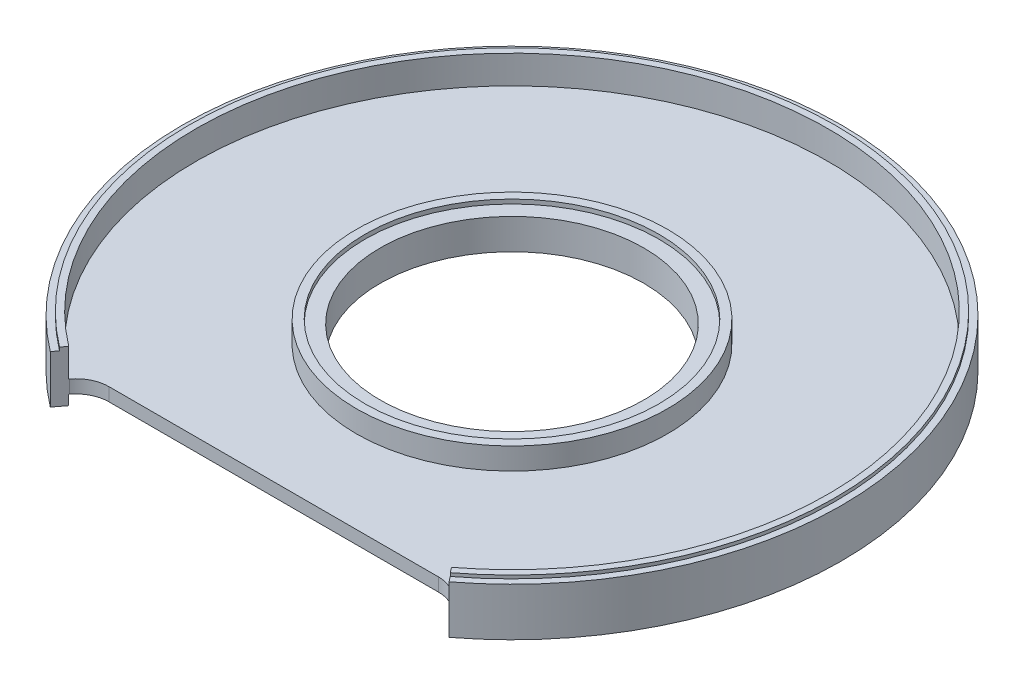
ISO-10303-21;
HEADER;
FILE_DESCRIPTION(('STEP AP214'),'2;1');
FILE_NAME('part.step','',(''),(''),'','','');
FILE_SCHEMA(('AUTOMOTIVE_DESIGN { 1 0 10303 214 1 1 1 1 }'));
ENDSEC;
DATA;
#1=APPLICATION_CONTEXT('core data for automotive mechanical design processes');
#2=APPLICATION_PROTOCOL_DEFINITION('international standard','automotive_design',2000,#1);
#3=PRODUCT_CONTEXT('',#1,'mechanical');
#4=PRODUCT('Part','Part','',(#3));
#5=PRODUCT_RELATED_PRODUCT_CATEGORY('part','',(#4));
#6=PRODUCT_DEFINITION_FORMATION('','',#4);
#7=PRODUCT_DEFINITION_CONTEXT('part definition',#1,'design');
#8=PRODUCT_DEFINITION('design','',#6,#7);
#9=PRODUCT_DEFINITION_SHAPE('','',#8);
#10=(LENGTH_UNIT() NAMED_UNIT(*) SI_UNIT(.MILLI.,.METRE.));
#11=(NAMED_UNIT(*) PLANE_ANGLE_UNIT() SI_UNIT($,.RADIAN.));
#12=(NAMED_UNIT(*) SI_UNIT($,.STERADIAN.) SOLID_ANGLE_UNIT());
#13=UNCERTAINTY_MEASURE_WITH_UNIT(LENGTH_MEASURE(1.E-05),#10,'distance_accuracy_value','');
#14=(GEOMETRIC_REPRESENTATION_CONTEXT(3) GLOBAL_UNCERTAINTY_ASSIGNED_CONTEXT((#13)) GLOBAL_UNIT_ASSIGNED_CONTEXT((#10,
#11,#12)) REPRESENTATION_CONTEXT('',''));
#15=CARTESIAN_POINT('',(0.,0.,0.));
#16=DIRECTION('',(0.,0.,1.));
#17=DIRECTION('',(1.,0.,0.));
#18=AXIS2_PLACEMENT_3D('',#15,#16,#17);
#19=CARTESIAN_POINT('',(0.,0.,0.));
#20=DIRECTION('',(0.,-1.,0.));
#21=DIRECTION('',(0.,0.,-1.));
#22=AXIS2_PLACEMENT_3D('',#19,#20,#21);
#23=CYLINDRICAL_SURFACE('',#22,23.6);
#24=CARTESIAN_POINT('',(0.,3.15,0.));
#25=DIRECTION('',(0.,-1.,0.));
#26=DIRECTION('',(0.,0.,-1.));
#27=AXIS2_PLACEMENT_3D('',#24,#25,#26);
#28=CIRCLE('',#27,23.6);
#29=CARTESIAN_POINT('',(0.,3.15,-23.6));
#30=VERTEX_POINT('',#29);
#31=EDGE_CURVE('E230',#30,#30,#28,.T.);
#32=ORIENTED_EDGE('',*,*,#31,.T.);
#33=EDGE_LOOP('',(#32));
#34=FACE_BOUND('',#33,.T.);
#35=CARTESIAN_POINT('',(0.,-0.149999999999998,0.));
#36=DIRECTION('',(0.,-1.,0.));
#37=DIRECTION('',(0.,0.,-1.));
#38=AXIS2_PLACEMENT_3D('',#35,#36,#37);
#39=CIRCLE('',#38,23.6);
#40=CARTESIAN_POINT('',(0.,-0.149999999999998,-23.6));
#41=VERTEX_POINT('',#40);
#42=EDGE_CURVE('E163',#41,#41,#39,.T.);
#43=ORIENTED_EDGE('',*,*,#42,.F.);
#44=EDGE_LOOP('',(#43));
#45=FACE_BOUND('',#44,.T.);
#46=ADVANCED_FACE('F34',(#34,#45),#23,.T.);
#47=CARTESIAN_POINT('',(0.,-0.149999999999998,0.));
#48=DIRECTION('',(0.,1.,0.));
#49=DIRECTION('',(0.,0.,1.));
#50=AXIS2_PLACEMENT_3D('',#47,#48,#49);
#51=PLANE('',#50);
#52=DIRECTION('',(-0.605050133097882,0.,0.796187375206513));
#53=VECTOR('',#52,1.);
#54=CARTESIAN_POINT('',(0.000282849567721906,-0.149999999999998,0.000214947101556877));
#55=LINE('',#54,#53);
#56=CARTESIAN_POINT('',(-28.9809368760326,-0.149999999999956,38.1366932343909));
#57=VERTEX_POINT('',#56);
#58=CARTESIAN_POINT('',(-29.0421235383352,-0.149999999999998,38.2172089559674));
#59=VERTEX_POINT('',#58);
#60=EDGE_CURVE('E56',#57,#59,#55,.T.);
#61=ORIENTED_EDGE('',*,*,#60,.F.);
#62=CARTESIAN_POINT('',(-25.,-0.150000000000011,41.1619438998803));
#63=DIRECTION('',(0.,1.,0.));
#64=DIRECTION('',(0.,0.,1.));
#65=AXIS2_PLACEMENT_3D('',#62,#63,#64);
#66=CIRCLE('',#65,5.);
#67=CARTESIAN_POINT('',(-25.,-0.149999999999956,36.1619438998803));
#68=VERTEX_POINT('',#67);
#69=EDGE_CURVE('E213',#68,#57,#66,.T.);
#70=ORIENTED_EDGE('',*,*,#69,.F.);
#71=DIRECTION('',(-1.,0.,0.));
#72=VECTOR('',#71,1.);
#73=CARTESIAN_POINT('',(0.,-0.149999999999998,36.1619438998803));
#74=LINE('',#73,#72);
#75=CARTESIAN_POINT('',(25.,-0.149999999999956,36.1619438998803));
#76=VERTEX_POINT('',#75);
#77=EDGE_CURVE('E192',#76,#68,#74,.T.);
#78=ORIENTED_EDGE('',*,*,#77,.F.);
#79=CARTESIAN_POINT('',(25.,-0.150000000000011,41.1619438998803));
#80=DIRECTION('',(0.,1.,0.));
#81=DIRECTION('',(0.,0.,1.));
#82=AXIS2_PLACEMENT_3D('',#79,#80,#81);
#83=CIRCLE('',#82,5.);
#84=CARTESIAN_POINT('',(28.9809593135091,-0.149999999999956,38.1367227601642));
#85=VERTEX_POINT('',#84);
#86=EDGE_CURVE('E210',#85,#76,#83,.T.);
#87=ORIENTED_EDGE('',*,*,#86,.F.);
#88=DIRECTION('',(-0.605044227943225,0.,-0.796191862701816));
#89=VECTOR('',#88,1.);
#90=CARTESIAN_POINT('',(0.,-0.149999999999998,0.));
#91=LINE('',#90,#89);
#92=CARTESIAN_POINT('',(29.0421229412748,-0.149999999999998,38.2172094096872));
#93=VERTEX_POINT('',#92);
#94=EDGE_CURVE('E208',#93,#85,#91,.T.);
#95=ORIENTED_EDGE('',*,*,#94,.F.);
#96=CARTESIAN_POINT('',(0.,-0.149999999999998,0.));
#97=DIRECTION('',(0.,-1.,0.));
#98=DIRECTION('',(0.,0.,-1.));
#99=AXIS2_PLACEMENT_3D('',#96,#97,#98);
#100=CIRCLE('',#99,48.);
#101=EDGE_CURVE('E160',#59,#93,#100,.T.);
#102=ORIENTED_EDGE('',*,*,#101,.F.);
#103=EDGE_LOOP('',(#61,#70,#78,#87,#95,#102));
#104=FACE_BOUND('',#103,.T.);
#105=ORIENTED_EDGE('',*,*,#42,.T.);
#106=EDGE_LOOP('',(#105));
#107=FACE_BOUND('',#106,.T.);
#108=ADVANCED_FACE('F269',(#104,#107),#51,.T.);
#109=CARTESIAN_POINT('',(0.,0.,0.));
#110=DIRECTION('',(0.,-1.,0.));
#111=DIRECTION('',(0.,0.,-1.));
#112=AXIS2_PLACEMENT_3D('',#109,#110,#111);
#113=CYLINDRICAL_SURFACE('',#112,48.);
#114=DIRECTION('',(0.,-1.,0.));
#115=VECTOR('',#114,1.);
#116=CARTESIAN_POINT('',(-29.0421235383352,0.,38.2172089559674));
#117=LINE('',#116,#115);
#118=CARTESIAN_POINT('',(-29.0421235383352,4.15,38.2172089559674));
#119=VERTEX_POINT('',#118);
#120=EDGE_CURVE('E227',#59,#119,#117,.F.);
#121=ORIENTED_EDGE('',*,*,#120,.F.);
#122=ORIENTED_EDGE('',*,*,#101,.T.);
#123=DIRECTION('',(0.,-1.,0.));
#124=VECTOR('',#123,1.);
#125=CARTESIAN_POINT('',(29.0421229412748,0.,38.2172094096872));
#126=LINE('',#125,#124);
#127=CARTESIAN_POINT('',(29.0421229412748,4.15,38.2172094096872));
#128=VERTEX_POINT('',#127);
#129=EDGE_CURVE('E206',#128,#93,#126,.T.);
#130=ORIENTED_EDGE('',*,*,#129,.F.);
#131=CARTESIAN_POINT('',(0.,4.15,0.));
#132=DIRECTION('',(0.,-1.,0.));
#133=DIRECTION('',(0.,0.,-1.));
#134=AXIS2_PLACEMENT_3D('',#131,#132,#133);
#135=CIRCLE('',#134,48.);
#136=EDGE_CURVE('E157',#119,#128,#135,.T.);
#137=ORIENTED_EDGE('',*,*,#136,.F.);
#138=EDGE_LOOP('',(#121,#122,#130,#137));
#139=FACE_BOUND('',#138,.T.);
#140=ADVANCED_FACE('F264',(#139),#113,.F.);
#141=CARTESIAN_POINT('',(0.,4.15,0.));
#142=DIRECTION('',(0.,-1.,0.));
#143=DIRECTION('',(0.,0.,-1.));
#144=AXIS2_PLACEMENT_3D('',#141,#142,#143);
#145=PLANE('',#144);
#146=CARTESIAN_POINT('',(0.,4.15,0.));
#147=DIRECTION('',(0.,-1.,0.));
#148=DIRECTION('',(0.,0.,-1.));
#149=AXIS2_PLACEMENT_3D('',#146,#147,#148);
#150=CIRCLE('',#149,49.);
#151=CARTESIAN_POINT('',(-29.6471736714493,4.15,39.0133963311953));
#152=VERTEX_POINT('',#151);
#153=CARTESIAN_POINT('',(29.647167169218,4.15,39.013401272389));
#154=VERTEX_POINT('',#153);
#155=EDGE_CURVE('E149',#152,#154,#150,.T.);
#156=ORIENTED_EDGE('',*,*,#155,.F.);
#157=DIRECTION('',(0.605050133097882,0.,-0.796187375206513));
#158=VECTOR('',#157,1.);
#159=CARTESIAN_POINT('',(0.000282849567721906,4.15,0.000214947101556877));
#160=LINE('',#159,#158);
#161=EDGE_CURVE('E224',#152,#119,#160,.T.);
#162=ORIENTED_EDGE('',*,*,#161,.T.);
#163=ORIENTED_EDGE('',*,*,#136,.T.);
#164=DIRECTION('',(0.605044227943225,0.,0.796191862701816));
#165=VECTOR('',#164,1.);
#166=CARTESIAN_POINT('',(0.,4.15,0.));
#167=LINE('',#166,#165);
#168=EDGE_CURVE('E203',#128,#154,#167,.T.);
#169=ORIENTED_EDGE('',*,*,#168,.T.);
#170=EDGE_LOOP('',(#156,#162,#163,#169));
#171=FACE_BOUND('',#170,.T.);
#172=ADVANCED_FACE('F261',(#171),#145,.F.);
#173=CARTESIAN_POINT('',(0.,0.,0.));
#174=DIRECTION('',(0.,-1.,0.));
#175=DIRECTION('',(0.,0.,-1.));
#176=AXIS2_PLACEMENT_3D('',#173,#174,#175);
#177=CYLINDRICAL_SURFACE('',#176,49.);
#178=DIRECTION('',(0.,-1.,0.));
#179=VECTOR('',#178,1.);
#180=CARTESIAN_POINT('',(-29.6471736714493,0.,39.0133963311953));
#181=LINE('',#180,#179);
#182=CARTESIAN_POINT('',(-29.6471736714493,3.65,39.0133963311953));
#183=VERTEX_POINT('',#182);
#184=EDGE_CURVE('E222',#152,#183,#181,.T.);
#185=ORIENTED_EDGE('',*,*,#184,.F.);
#186=ORIENTED_EDGE('',*,*,#155,.T.);
#187=DIRECTION('',(0.,-1.,0.));
#188=VECTOR('',#187,1.);
#189=CARTESIAN_POINT('',(29.647167169218,0.,39.013401272389));
#190=LINE('',#189,#188);
#191=CARTESIAN_POINT('',(29.647167169218,3.65,39.013401272389));
#192=VERTEX_POINT('',#191);
#193=EDGE_CURVE('E142',#192,#154,#190,.F.);
#194=ORIENTED_EDGE('',*,*,#193,.F.);
#195=CARTESIAN_POINT('',(0.,3.65,0.));
#196=DIRECTION('',(0.,-1.,0.));
#197=DIRECTION('',(0.,0.,-1.));
#198=AXIS2_PLACEMENT_3D('',#195,#196,#197);
#199=CIRCLE('',#198,49.);
#200=EDGE_CURVE('E141',#183,#192,#199,.T.);
#201=ORIENTED_EDGE('',*,*,#200,.F.);
#202=EDGE_LOOP('',(#185,#186,#194,#201));
#203=FACE_BOUND('',#202,.T.);
#204=ADVANCED_FACE('F257',(#203),#177,.T.);
#205=CARTESIAN_POINT('',(0.,3.65,0.));
#206=DIRECTION('',(0.,1.,0.));
#207=DIRECTION('',(0.,0.,1.));
#208=AXIS2_PLACEMENT_3D('',#205,#206,#207);
#209=PLANE('',#208);
#210=DIRECTION('',(-0.605050133097882,0.,0.796187375206513));
#211=VECTOR('',#210,1.);
#212=CARTESIAN_POINT('',(0.000282849567721906,3.65,0.000214947101556877));
#213=LINE('',#212,#211);
#214=CARTESIAN_POINT('',(-30.2522238045627,3.65000000000007,39.8095837064223));
#215=VERTEX_POINT('',#214);
#216=EDGE_CURVE('E220',#183,#215,#213,.T.);
#217=ORIENTED_EDGE('',*,*,#216,.F.);
#218=ORIENTED_EDGE('',*,*,#200,.T.);
#219=DIRECTION('',(-0.605044227943225,0.,-0.796191862701816));
#220=VECTOR('',#219,1.);
#221=CARTESIAN_POINT('',(0.,3.65,0.));
#222=LINE('',#221,#220);
#223=CARTESIAN_POINT('',(30.2522113971612,3.65000000000007,39.8095931350908));
#224=VERTEX_POINT('',#223);
#225=EDGE_CURVE('E124',#224,#192,#222,.T.);
#226=ORIENTED_EDGE('',*,*,#225,.F.);
#227=CARTESIAN_POINT('',(0.,3.65,0.));
#228=DIRECTION('',(0.,-1.,0.));
#229=DIRECTION('',(0.,0.,-1.));
#230=AXIS2_PLACEMENT_3D('',#227,#228,#229);
#231=CIRCLE('',#230,50.);
#232=EDGE_CURVE('E139',#215,#224,#231,.T.);
#233=ORIENTED_EDGE('',*,*,#232,.F.);
#234=EDGE_LOOP('',(#217,#218,#226,#233));
#235=FACE_BOUND('',#234,.T.);
#236=ADVANCED_FACE('F138',(#235),#209,.T.);
#237=CARTESIAN_POINT('',(0.,0.,0.));
#238=DIRECTION('',(0.,-1.,0.));
#239=DIRECTION('',(0.,0.,-1.));
#240=AXIS2_PLACEMENT_3D('',#237,#238,#239);
#241=CYLINDRICAL_SURFACE('',#240,50.);
#242=CARTESIAN_POINT('',(0.,-3.65,0.));
#243=DIRECTION('',(0.,-1.,0.));
#244=DIRECTION('',(0.,0.,-1.));
#245=AXIS2_PLACEMENT_3D('',#242,#243,#244);
#246=CIRCLE('',#245,50.);
#247=CARTESIAN_POINT('',(-30.2522238045627,-3.64999999999993,39.8095837064223));
#248=VERTEX_POINT('',#247);
#249=CARTESIAN_POINT('',(30.2522113971612,-3.64999999999993,39.8095931350908));
#250=VERTEX_POINT('',#249);
#251=EDGE_CURVE('E147',#248,#250,#246,.T.);
#252=ORIENTED_EDGE('',*,*,#251,.F.);
#253=DIRECTION('',(0.,-1.,0.));
#254=VECTOR('',#253,1.);
#255=CARTESIAN_POINT('',(-30.2522238045627,180.982868479382,39.8095837064223));
#256=LINE('',#255,#254);
#257=EDGE_CURVE('E146',#215,#248,#256,.T.);
#258=ORIENTED_EDGE('',*,*,#257,.F.);
#259=ORIENTED_EDGE('',*,*,#232,.T.);
#260=DIRECTION('',(0.,-1.,0.));
#261=VECTOR('',#260,1.);
#262=CARTESIAN_POINT('',(30.2522113971612,180.982868479382,39.8095931350908));
#263=LINE('',#262,#261);
#264=EDGE_CURVE('E121',#224,#250,#263,.T.);
#265=ORIENTED_EDGE('',*,*,#264,.T.);
#266=EDGE_LOOP('',(#252,#258,#259,#265));
#267=FACE_BOUND('',#266,.T.);
#268=ADVANCED_FACE('F145',(#267),#241,.T.);
#269=CARTESIAN_POINT('',(0.,-3.65,0.));
#270=DIRECTION('',(0.,1.,0.));
#271=DIRECTION('',(0.,0.,1.));
#272=AXIS2_PLACEMENT_3D('',#269,#270,#271);
#273=PLANE('',#272);
#274=CARTESIAN_POINT('',(0.,-3.65,0.));
#275=DIRECTION('',(0.,-1.,0.));
#276=DIRECTION('',(0.,0.,-1.));
#277=AXIS2_PLACEMENT_3D('',#274,#275,#276);
#278=CIRCLE('',#277,48.);
#279=CARTESIAN_POINT('',(-29.0421235383352,-3.65,38.2172089559674));
#280=VERTEX_POINT('',#279);
#281=CARTESIAN_POINT('',(29.0421229412748,-3.65,38.2172094096872));
#282=VERTEX_POINT('',#281);
#283=EDGE_CURVE('E151',#280,#282,#278,.T.);
#284=ORIENTED_EDGE('',*,*,#283,.F.);
#285=DIRECTION('',(-0.605050133097882,0.,0.796187375206513));
#286=VECTOR('',#285,1.);
#287=CARTESIAN_POINT('',(0.000282849567721906,-3.65,0.000214947101556877));
#288=LINE('',#287,#286);
#289=EDGE_CURVE('E217',#280,#248,#288,.T.);
#290=ORIENTED_EDGE('',*,*,#289,.T.);
#291=ORIENTED_EDGE('',*,*,#251,.T.);
#292=DIRECTION('',(-0.605044227943225,0.,-0.796191862701816));
#293=VECTOR('',#292,1.);
#294=CARTESIAN_POINT('',(0.,-3.65,0.));
#295=LINE('',#294,#293);
#296=EDGE_CURVE('E127',#250,#282,#295,.T.);
#297=ORIENTED_EDGE('',*,*,#296,.T.);
#298=EDGE_LOOP('',(#284,#290,#291,#297));
#299=FACE_BOUND('',#298,.T.);
#300=ADVANCED_FACE('F253',(#299),#273,.F.);
#301=DIRECTION('',(0.,-1.,0.));
#302=VECTOR('',#301,1.);
#303=CARTESIAN_POINT('',(-29.0421235383352,0.,38.2172089559674));
#304=LINE('',#303,#302);
#305=CARTESIAN_POINT('',(-29.0421235383352,-2.15,38.2172089559674));
#306=VERTEX_POINT('',#305);
#307=EDGE_CURVE('E215',#280,#306,#304,.F.);
#308=ORIENTED_EDGE('',*,*,#307,.F.);
#309=ORIENTED_EDGE('',*,*,#283,.T.);
#310=DIRECTION('',(0.,-1.,0.));
#311=VECTOR('',#310,1.);
#312=CARTESIAN_POINT('',(29.0421229412748,0.,38.2172094096872));
#313=LINE('',#312,#311);
#314=CARTESIAN_POINT('',(29.0421229412748,-2.15,38.2172094096872));
#315=VERTEX_POINT('',#314);
#316=EDGE_CURVE('E198',#315,#282,#313,.T.);
#317=ORIENTED_EDGE('',*,*,#316,.F.);
#318=CARTESIAN_POINT('',(0.,-2.15,0.));
#319=DIRECTION('',(0.,-1.,0.));
#320=DIRECTION('',(0.,0.,-1.));
#321=AXIS2_PLACEMENT_3D('',#318,#319,#320);
#322=CIRCLE('',#321,48.);
#323=EDGE_CURVE('E245',#306,#315,#322,.T.);
#324=ORIENTED_EDGE('',*,*,#323,.F.);
#325=EDGE_LOOP('',(#308,#309,#317,#324));
#326=FACE_BOUND('',#325,.T.);
#327=ADVANCED_FACE('F251',(#326),#113,.F.);
#328=CARTESIAN_POINT('',(0.,-2.15,0.));
#329=DIRECTION('',(0.,1.,0.));
#330=DIRECTION('',(0.,0.,1.));
#331=AXIS2_PLACEMENT_3D('',#328,#329,#330);
#332=PLANE('',#331);
#333=CARTESIAN_POINT('',(0.,-2.15,0.));
#334=DIRECTION('',(0.,-1.,0.));
#335=DIRECTION('',(0.,0.,-1.));
#336=AXIS2_PLACEMENT_3D('',#333,#334,#335);
#337=CIRCLE('',#336,20.);
#338=CARTESIAN_POINT('',(0.,-2.15,-20.));
#339=VERTEX_POINT('',#338);
#340=EDGE_CURVE('E242',#339,#339,#337,.T.);
#341=ORIENTED_EDGE('',*,*,#340,.F.);
#342=EDGE_LOOP('',(#341));
#343=FACE_BOUND('',#342,.T.);
#344=CARTESIAN_POINT('',(-25.,-2.14999999999999,41.1619438998803));
#345=DIRECTION('',(0.,1.,0.));
#346=DIRECTION('',(0.,0.,1.));
#347=AXIS2_PLACEMENT_3D('',#344,#345,#346);
#348=CIRCLE('',#347,5.);
#349=CARTESIAN_POINT('',(-25.,-2.14999999999993,36.1619438998803));
#350=VERTEX_POINT('',#349);
#351=CARTESIAN_POINT('',(-28.9809368760326,-2.14999999999993,38.1366932343909));
#352=VERTEX_POINT('',#351);
#353=EDGE_CURVE('E41',#350,#352,#348,.T.);
#354=ORIENTED_EDGE('',*,*,#353,.T.);
#355=DIRECTION('',(-0.605050133097882,0.,0.796187375206513));
#356=VECTOR('',#355,1.);
#357=CARTESIAN_POINT('',(0.000282849567721906,-2.15,0.000214947101556843));
#358=LINE('',#357,#356);
#359=EDGE_CURVE('E11',#352,#306,#358,.T.);
#360=ORIENTED_EDGE('',*,*,#359,.T.);
#361=ORIENTED_EDGE('',*,*,#323,.T.);
#362=DIRECTION('',(-0.605044227943225,0.,-0.796191862701816));
#363=VECTOR('',#362,1.);
#364=CARTESIAN_POINT('',(0.,-2.15,0.));
#365=LINE('',#364,#363);
#366=CARTESIAN_POINT('',(28.9809593135091,-2.15,38.1367227601642));
#367=VERTEX_POINT('',#366);
#368=EDGE_CURVE('E166',#315,#367,#365,.T.);
#369=ORIENTED_EDGE('',*,*,#368,.T.);
#370=CARTESIAN_POINT('',(25.,-2.14999999999999,41.1619438998803));
#371=DIRECTION('',(0.,1.,0.));
#372=DIRECTION('',(0.,0.,1.));
#373=AXIS2_PLACEMENT_3D('',#370,#371,#372);
#374=CIRCLE('',#373,5.);
#375=CARTESIAN_POINT('',(25.,-2.14999999999993,36.1619438998803));
#376=VERTEX_POINT('',#375);
#377=EDGE_CURVE('E169',#367,#376,#374,.T.);
#378=ORIENTED_EDGE('',*,*,#377,.T.);
#379=DIRECTION('',(-1.,0.,0.));
#380=VECTOR('',#379,1.);
#381=CARTESIAN_POINT('',(0.,-2.15,36.1619438998803));
#382=LINE('',#381,#380);
#383=EDGE_CURVE('E172',#376,#350,#382,.T.);
#384=ORIENTED_EDGE('',*,*,#383,.T.);
#385=EDGE_LOOP('',(#354,#360,#361,#369,#378,#384));
#386=FACE_BOUND('',#385,.T.);
#387=ADVANCED_FACE('F176',(#343,#386),#332,.F.);
#388=CARTESIAN_POINT('',(0.,0.,0.));
#389=DIRECTION('',(0.,-1.,0.));
#390=DIRECTION('',(0.,0.,-1.));
#391=AXIS2_PLACEMENT_3D('',#388,#389,#390);
#392=CYLINDRICAL_SURFACE('',#391,20.);
#393=ORIENTED_EDGE('',*,*,#340,.T.);
#394=EDGE_LOOP('',(#393));
#395=FACE_BOUND('',#394,.T.);
#396=CARTESIAN_POINT('',(0.,2.5,0.));
#397=DIRECTION('',(0.,-1.,0.));
#398=DIRECTION('',(0.,0.,-1.));
#399=AXIS2_PLACEMENT_3D('',#396,#397,#398);
#400=CIRCLE('',#399,20.);
#401=CARTESIAN_POINT('',(0.,2.5,-20.));
#402=VERTEX_POINT('',#401);
#403=EDGE_CURVE('E239',#402,#402,#400,.T.);
#404=ORIENTED_EDGE('',*,*,#403,.F.);
#405=EDGE_LOOP('',(#404));
#406=FACE_BOUND('',#405,.T.);
#407=ADVANCED_FACE('F307',(#395,#406),#392,.F.);
#408=CARTESIAN_POINT('',(0.,2.5,0.));
#409=DIRECTION('',(0.,1.,0.));
#410=DIRECTION('',(0.,0.,1.));
#411=AXIS2_PLACEMENT_3D('',#408,#409,#410);
#412=PLANE('',#411);
#413=ORIENTED_EDGE('',*,*,#403,.T.);
#414=EDGE_LOOP('',(#413));
#415=FACE_BOUND('',#414,.T.);
#416=CARTESIAN_POINT('',(0.,2.5,0.));
#417=DIRECTION('',(0.,-1.,0.));
#418=DIRECTION('',(0.,0.,-1.));
#419=AXIS2_PLACEMENT_3D('',#416,#417,#418);
#420=CIRCLE('',#419,22.3);
#421=CARTESIAN_POINT('',(0.,2.5,-22.3));
#422=VERTEX_POINT('',#421);
#423=EDGE_CURVE('E236',#422,#422,#420,.T.);
#424=ORIENTED_EDGE('',*,*,#423,.F.);
#425=EDGE_LOOP('',(#424));
#426=FACE_BOUND('',#425,.T.);
#427=ADVANCED_FACE('F300',(#415,#426),#412,.T.);
#428=CARTESIAN_POINT('',(0.,0.,0.));
#429=DIRECTION('',(0.,-1.,0.));
#430=DIRECTION('',(0.,0.,-1.));
#431=AXIS2_PLACEMENT_3D('',#428,#429,#430);
#432=CYLINDRICAL_SURFACE('',#431,22.3);
#433=CARTESIAN_POINT('',(0.,3.15,0.));
#434=DIRECTION('',(0.,-1.,0.));
#435=DIRECTION('',(0.,0.,-1.));
#436=AXIS2_PLACEMENT_3D('',#433,#434,#435);
#437=CIRCLE('',#436,22.3);
#438=CARTESIAN_POINT('',(0.,3.15,-22.3));
#439=VERTEX_POINT('',#438);
#440=EDGE_CURVE('E233',#439,#439,#437,.T.);
#441=ORIENTED_EDGE('',*,*,#440,.F.);
#442=EDGE_LOOP('',(#441));
#443=FACE_BOUND('',#442,.T.);
#444=ORIENTED_EDGE('',*,*,#423,.T.);
#445=EDGE_LOOP('',(#444));
#446=FACE_BOUND('',#445,.T.);
#447=ADVANCED_FACE('F292',(#443,#446),#432,.F.);
#448=CARTESIAN_POINT('',(0.,3.15,0.));
#449=DIRECTION('',(0.,1.,0.));
#450=DIRECTION('',(0.,0.,1.));
#451=AXIS2_PLACEMENT_3D('',#448,#449,#450);
#452=PLANE('',#451);
#453=ORIENTED_EDGE('',*,*,#440,.T.);
#454=EDGE_LOOP('',(#453));
#455=FACE_BOUND('',#454,.T.);
#456=ORIENTED_EDGE('',*,*,#31,.F.);
#457=EDGE_LOOP('',(#456));
#458=FACE_BOUND('',#457,.T.);
#459=ADVANCED_FACE('F290',(#455,#458),#452,.T.);
#460=CARTESIAN_POINT('',(-28.9809368760326,180.982868479382,38.1366932343909));
#461=DIRECTION('',(-0.796187375206512,0.,-0.605050133097882));
#462=DIRECTION('',(-0.605050133097882,0.,0.796187375206513));
#463=AXIS2_PLACEMENT_3D('',#460,#461,#462);
#464=PLANE('',#463);
#465=DIRECTION('',(0.,-1.,0.));
#466=VECTOR('',#465,1.);
#467=CARTESIAN_POINT('',(-28.9809368760326,180.982868479382,38.1366932343909));
#468=LINE('',#467,#466);
#469=EDGE_CURVE('E186',#57,#352,#468,.T.);
#470=ORIENTED_EDGE('',*,*,#469,.F.);
#471=ORIENTED_EDGE('',*,*,#60,.T.);
#472=ORIENTED_EDGE('',*,*,#120,.T.);
#473=ORIENTED_EDGE('',*,*,#161,.F.);
#474=ORIENTED_EDGE('',*,*,#184,.T.);
#475=ORIENTED_EDGE('',*,*,#216,.T.);
#476=ORIENTED_EDGE('',*,*,#257,.T.);
#477=ORIENTED_EDGE('',*,*,#289,.F.);
#478=ORIENTED_EDGE('',*,*,#307,.T.);
#479=ORIENTED_EDGE('',*,*,#359,.F.);
#480=EDGE_LOOP('',(#470,#471,#472,#473,#474,#475,#476,#477,#478,#479));
#481=FACE_BOUND('',#480,.T.);
#482=ADVANCED_FACE('F254',(#481),#464,.F.);
#483=CARTESIAN_POINT('',(-25.,180.982868479382,41.1619438998803));
#484=DIRECTION('',(0.,-1.,0.));
#485=DIRECTION('',(0.,0.,-1.));
#486=AXIS2_PLACEMENT_3D('',#483,#484,#485);
#487=CYLINDRICAL_SURFACE('',#486,5.);
#488=DIRECTION('',(0.,-1.,0.));
#489=VECTOR('',#488,1.);
#490=CARTESIAN_POINT('',(-25.,180.982868479382,36.1619438998803));
#491=LINE('',#490,#489);
#492=EDGE_CURVE('E184',#68,#350,#491,.T.);
#493=ORIENTED_EDGE('',*,*,#492,.F.);
#494=ORIENTED_EDGE('',*,*,#69,.T.);
#495=ORIENTED_EDGE('',*,*,#469,.T.);
#496=ORIENTED_EDGE('',*,*,#353,.F.);
#497=EDGE_LOOP('',(#493,#494,#495,#496));
#498=FACE_BOUND('',#497,.T.);
#499=ADVANCED_FACE('F183',(#498),#487,.F.);
#500=CARTESIAN_POINT('',(-25.,180.982868479382,36.1619438998803));
#501=DIRECTION('',(0.,0.,-1.));
#502=DIRECTION('',(-1.,0.,0.));
#503=AXIS2_PLACEMENT_3D('',#500,#501,#502);
#504=PLANE('',#503);
#505=DIRECTION('',(0.,-1.,0.));
#506=VECTOR('',#505,1.);
#507=CARTESIAN_POINT('',(25.,180.982868479382,36.1619438998803));
#508=LINE('',#507,#506);
#509=EDGE_CURVE('E132',#76,#376,#508,.T.);
#510=ORIENTED_EDGE('',*,*,#509,.F.);
#511=ORIENTED_EDGE('',*,*,#77,.T.);
#512=ORIENTED_EDGE('',*,*,#492,.T.);
#513=ORIENTED_EDGE('',*,*,#383,.F.);
#514=EDGE_LOOP('',(#510,#511,#512,#513));
#515=FACE_BOUND('',#514,.T.);
#516=ADVANCED_FACE('F189',(#515),#504,.F.);
#517=CARTESIAN_POINT('',(25.,180.982868479382,41.1619438998803));
#518=DIRECTION('',(0.,-1.,0.));
#519=DIRECTION('',(0.,0.,-1.));
#520=AXIS2_PLACEMENT_3D('',#517,#518,#519);
#521=CYLINDRICAL_SURFACE('',#520,5.);
#522=DIRECTION('',(0.,-1.,0.));
#523=VECTOR('',#522,1.);
#524=CARTESIAN_POINT('',(28.9809593135091,180.982868479382,38.1367227601642));
#525=LINE('',#524,#523);
#526=EDGE_CURVE('E48',#85,#367,#525,.T.);
#527=ORIENTED_EDGE('',*,*,#526,.F.);
#528=ORIENTED_EDGE('',*,*,#86,.T.);
#529=ORIENTED_EDGE('',*,*,#509,.T.);
#530=ORIENTED_EDGE('',*,*,#377,.F.);
#531=EDGE_LOOP('',(#527,#528,#529,#530));
#532=FACE_BOUND('',#531,.T.);
#533=ADVANCED_FACE('F272',(#532),#521,.F.);
#534=CARTESIAN_POINT('',(28.9809593135091,180.982868479382,38.1367227601642));
#535=DIRECTION('',(0.796191862701816,0.,-0.605044227943225));
#536=DIRECTION('',(-0.605044227943225,0.,-0.796191862701816));
#537=AXIS2_PLACEMENT_3D('',#534,#535,#536);
#538=PLANE('',#537);
#539=ORIENTED_EDGE('',*,*,#129,.T.);
#540=ORIENTED_EDGE('',*,*,#94,.T.);
#541=ORIENTED_EDGE('',*,*,#526,.T.);
#542=ORIENTED_EDGE('',*,*,#368,.F.);
#543=ORIENTED_EDGE('',*,*,#316,.T.);
#544=ORIENTED_EDGE('',*,*,#296,.F.);
#545=ORIENTED_EDGE('',*,*,#264,.F.);
#546=ORIENTED_EDGE('',*,*,#225,.T.);
#547=ORIENTED_EDGE('',*,*,#193,.T.);
#548=ORIENTED_EDGE('',*,*,#168,.F.);
#549=EDGE_LOOP('',(#539,#540,#541,#542,#543,#544,#545,#546,#547,#548));
#550=FACE_BOUND('',#549,.T.);
#551=ADVANCED_FACE('F123',(#550),#538,.F.);
#552=CLOSED_SHELL('',(#46,#108,#140,#172,#204,#236,#268,#300,#327,#387,#407,#427,#447,#459,#482,
#499,#516,#533,#551));
#553=MANIFOLD_SOLID_BREP('B2',#552);
#554=ADVANCED_BREP_SHAPE_REPRESENTATION('',(#18,#553),#14);
#555=SHAPE_DEFINITION_REPRESENTATION(#9,#554);
ENDSEC;
END-ISO-10303-21;
